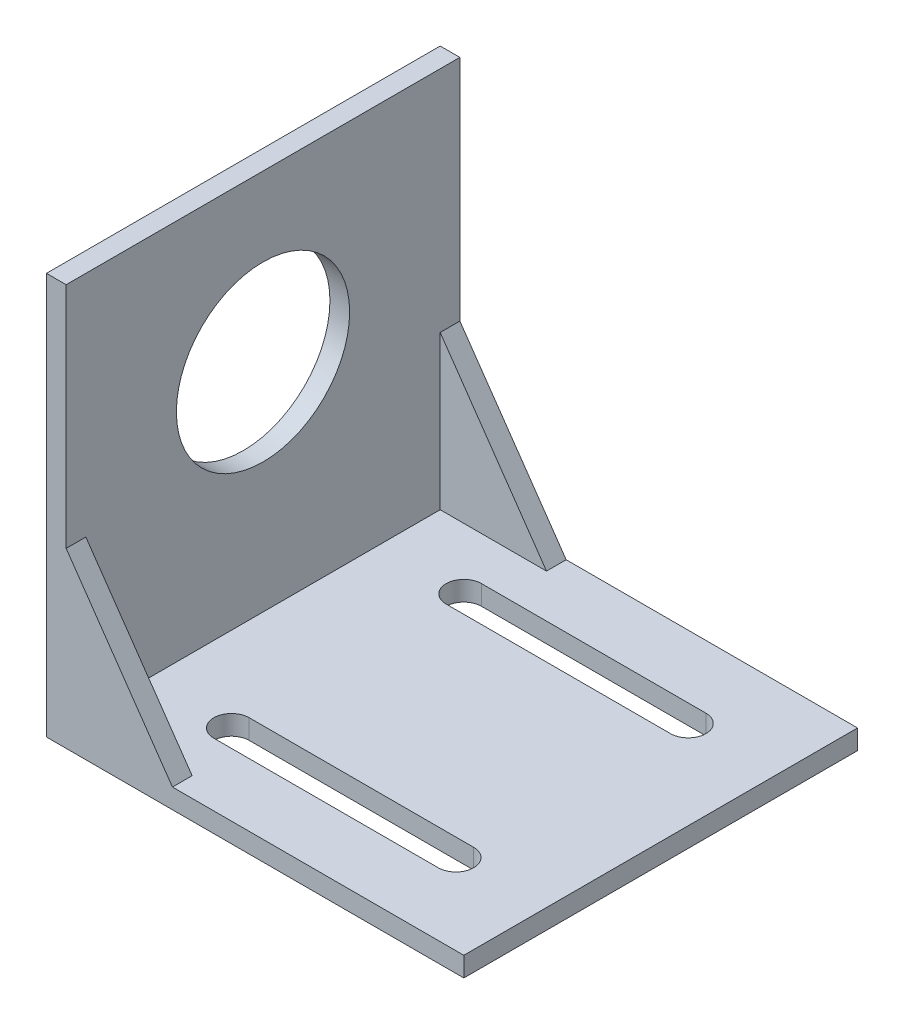
ISO-10303-21;
HEADER;
FILE_DESCRIPTION(('STEP AP214'),'2;1');
FILE_NAME('part.step','',(''),(''),'','','');
FILE_SCHEMA(('AUTOMOTIVE_DESIGN { 1 0 10303 214 1 1 1 1 }'));
ENDSEC;
DATA;
#1=APPLICATION_CONTEXT('core data for automotive mechanical design processes');
#2=APPLICATION_PROTOCOL_DEFINITION('international standard','automotive_design',2000,#1);
#3=PRODUCT_CONTEXT('',#1,'mechanical');
#4=PRODUCT('Part','Part','',(#3));
#5=PRODUCT_RELATED_PRODUCT_CATEGORY('part','',(#4));
#6=PRODUCT_DEFINITION_FORMATION('','',#4);
#7=PRODUCT_DEFINITION_CONTEXT('part definition',#1,'design');
#8=PRODUCT_DEFINITION('design','',#6,#7);
#9=PRODUCT_DEFINITION_SHAPE('','',#8);
#10=(LENGTH_UNIT() NAMED_UNIT(*) SI_UNIT(.MILLI.,.METRE.));
#11=(NAMED_UNIT(*) PLANE_ANGLE_UNIT() SI_UNIT($,.RADIAN.));
#12=(NAMED_UNIT(*) SI_UNIT($,.STERADIAN.) SOLID_ANGLE_UNIT());
#13=UNCERTAINTY_MEASURE_WITH_UNIT(LENGTH_MEASURE(1.E-05),#10,'distance_accuracy_value','');
#14=(GEOMETRIC_REPRESENTATION_CONTEXT(3) GLOBAL_UNCERTAINTY_ASSIGNED_CONTEXT((#13)) GLOBAL_UNIT_ASSIGNED_CONTEXT((#10,
#11,#12)) REPRESENTATION_CONTEXT('',''));
#15=CARTESIAN_POINT('',(0.,0.,0.));
#16=DIRECTION('',(0.,0.,1.));
#17=DIRECTION('',(1.,0.,0.));
#18=AXIS2_PLACEMENT_3D('',#15,#16,#17);
#19=CARTESIAN_POINT('',(2.50000000000001,2.5,25.));
#20=DIRECTION('',(0.,-1.,0.));
#21=DIRECTION('',(0.,0.,-1.));
#22=AXIS2_PLACEMENT_3D('',#19,#20,#21);
#23=PLANE('',#22);
#24=DIRECTION('',(1.,0.,0.));
#25=VECTOR('',#24,1.);
#26=CARTESIAN_POINT('',(13.25,2.5,17.));
#27=LINE('',#26,#25);
#28=CARTESIAN_POINT('',(13.25,2.5,17.));
#29=VERTEX_POINT('',#28);
#30=CARTESIAN_POINT('',(41.75,2.5,17.));
#31=VERTEX_POINT('',#30);
#32=EDGE_CURVE('E240',#29,#31,#27,.T.);
#33=ORIENTED_EDGE('',*,*,#32,.F.);
#34=CARTESIAN_POINT('',(13.25,2.5,14.75));
#35=DIRECTION('',(0.,1.,0.));
#36=DIRECTION('',(0.,0.,1.));
#37=AXIS2_PLACEMENT_3D('',#34,#35,#36);
#38=CIRCLE('',#37,2.25);
#39=CARTESIAN_POINT('',(13.25,2.5,12.5));
#40=VERTEX_POINT('',#39);
#41=EDGE_CURVE('E238',#40,#29,#38,.T.);
#42=ORIENTED_EDGE('',*,*,#41,.F.);
#43=DIRECTION('',(-1.,0.,0.));
#44=VECTOR('',#43,1.);
#45=CARTESIAN_POINT('',(13.25,2.5,12.5));
#46=LINE('',#45,#44);
#47=CARTESIAN_POINT('',(41.75,2.5,12.5));
#48=VERTEX_POINT('',#47);
#49=EDGE_CURVE('E246',#48,#40,#46,.T.);
#50=ORIENTED_EDGE('',*,*,#49,.F.);
#51=CARTESIAN_POINT('',(41.75,2.5,14.75));
#52=DIRECTION('',(0.,1.,0.));
#53=DIRECTION('',(0.,0.,1.));
#54=AXIS2_PLACEMENT_3D('',#51,#52,#53);
#55=CIRCLE('',#54,2.25);
#56=EDGE_CURVE('E243',#31,#48,#55,.T.);
#57=ORIENTED_EDGE('',*,*,#56,.F.);
#58=EDGE_LOOP('',(#33,#42,#50,#57));
#59=FACE_BOUND('',#58,.T.);
#60=DIRECTION('',(1.,0.,0.));
#61=VECTOR('',#60,1.);
#62=CARTESIAN_POINT('',(13.25,2.5,-12.5));
#63=LINE('',#62,#61);
#64=CARTESIAN_POINT('',(13.25,2.5,-12.5));
#65=VERTEX_POINT('',#64);
#66=CARTESIAN_POINT('',(41.75,2.5,-12.5));
#67=VERTEX_POINT('',#66);
#68=EDGE_CURVE('E341',#65,#67,#63,.T.);
#69=ORIENTED_EDGE('',*,*,#68,.F.);
#70=CARTESIAN_POINT('',(13.25,2.5,-14.75));
#71=DIRECTION('',(0.,1.,0.));
#72=DIRECTION('',(0.,0.,1.));
#73=AXIS2_PLACEMENT_3D('',#70,#71,#72);
#74=CIRCLE('',#73,2.25);
#75=CARTESIAN_POINT('',(13.25,2.5,-17.));
#76=VERTEX_POINT('',#75);
#77=EDGE_CURVE('E252',#76,#65,#74,.T.);
#78=ORIENTED_EDGE('',*,*,#77,.F.);
#79=DIRECTION('',(-1.,0.,0.));
#80=VECTOR('',#79,1.);
#81=CARTESIAN_POINT('',(13.25,2.5,-17.));
#82=LINE('',#81,#80);
#83=CARTESIAN_POINT('',(41.75,2.5,-17.));
#84=VERTEX_POINT('',#83);
#85=EDGE_CURVE('E237',#84,#76,#82,.T.);
#86=ORIENTED_EDGE('',*,*,#85,.F.);
#87=CARTESIAN_POINT('',(41.75,2.5,-14.75));
#88=DIRECTION('',(0.,1.,0.));
#89=DIRECTION('',(0.,0.,1.));
#90=AXIS2_PLACEMENT_3D('',#87,#88,#89);
#91=CIRCLE('',#90,2.25);
#92=EDGE_CURVE('E225',#67,#84,#91,.T.);
#93=ORIENTED_EDGE('',*,*,#92,.F.);
#94=EDGE_LOOP('',(#69,#78,#86,#93));
#95=FACE_BOUND('',#94,.T.);
#96=DIRECTION('',(0.,0.,-1.));
#97=VECTOR('',#96,1.);
#98=CARTESIAN_POINT('',(16.,2.5,-22.5));
#99=LINE('',#98,#97);
#100=CARTESIAN_POINT('',(16.,2.5,-22.5));
#101=VERTEX_POINT('',#100);
#102=CARTESIAN_POINT('',(16.,2.5,-25.));
#103=VERTEX_POINT('',#102);
#104=EDGE_CURVE('E53',#101,#103,#99,.T.);
#105=ORIENTED_EDGE('',*,*,#104,.F.);
#106=DIRECTION('',(1.,0.,0.));
#107=VECTOR('',#106,1.);
#108=CARTESIAN_POINT('',(16.,2.5,-22.5));
#109=LINE('',#108,#107);
#110=CARTESIAN_POINT('',(2.50000000000001,2.5,-22.5));
#111=VERTEX_POINT('',#110);
#112=EDGE_CURVE('E180',#111,#101,#109,.T.);
#113=ORIENTED_EDGE('',*,*,#112,.F.);
#114=DIRECTION('',(0.,0.,-1.));
#115=VECTOR('',#114,1.);
#116=CARTESIAN_POINT('',(2.50000000000001,2.5,25.));
#117=LINE('',#116,#115);
#118=CARTESIAN_POINT('',(2.50000000000001,2.5,22.5));
#119=VERTEX_POINT('',#118);
#120=EDGE_CURVE('E175',#119,#111,#117,.T.);
#121=ORIENTED_EDGE('',*,*,#120,.F.);
#122=DIRECTION('',(1.,0.,0.));
#123=VECTOR('',#122,1.);
#124=CARTESIAN_POINT('',(16.,2.5,22.5));
#125=LINE('',#124,#123);
#126=CARTESIAN_POINT('',(16.,2.5,22.5));
#127=VERTEX_POINT('',#126);
#128=EDGE_CURVE('E164',#119,#127,#125,.T.);
#129=ORIENTED_EDGE('',*,*,#128,.T.);
#130=DIRECTION('',(0.,0.,1.));
#131=VECTOR('',#130,1.);
#132=CARTESIAN_POINT('',(16.,2.5,22.5));
#133=LINE('',#132,#131);
#134=CARTESIAN_POINT('',(16.,2.5,25.));
#135=VERTEX_POINT('',#134);
#136=EDGE_CURVE('E333',#127,#135,#133,.T.);
#137=ORIENTED_EDGE('',*,*,#136,.T.);
#138=DIRECTION('',(-1.,0.,0.));
#139=VECTOR('',#138,1.);
#140=CARTESIAN_POINT('',(2.50000000000001,2.5,25.));
#141=LINE('',#140,#139);
#142=CARTESIAN_POINT('',(53.,2.5,25.));
#143=VERTEX_POINT('',#142);
#144=EDGE_CURVE('E262',#143,#135,#141,.T.);
#145=ORIENTED_EDGE('',*,*,#144,.F.);
#146=DIRECTION('',(0.,0.,-1.));
#147=VECTOR('',#146,1.);
#148=CARTESIAN_POINT('',(53.,2.5,25.));
#149=LINE('',#148,#147);
#150=CARTESIAN_POINT('',(53.,2.5,-25.));
#151=VERTEX_POINT('',#150);
#152=EDGE_CURVE('E181',#143,#151,#149,.T.);
#153=ORIENTED_EDGE('',*,*,#152,.T.);
#154=DIRECTION('',(-1.,0.,0.));
#155=VECTOR('',#154,1.);
#156=CARTESIAN_POINT('',(2.50000000000001,2.5,-25.));
#157=LINE('',#156,#155);
#158=EDGE_CURVE('E277',#151,#103,#157,.T.);
#159=ORIENTED_EDGE('',*,*,#158,.T.);
#160=EDGE_LOOP('',(#105,#113,#121,#129,#137,#145,#153,#159));
#161=FACE_BOUND('',#160,.T.);
#162=ADVANCED_FACE('F37',(#59,#95,#161),#23,.F.);
#163=CARTESIAN_POINT('',(2.5,51.,25.));
#164=DIRECTION('',(-1.,0.,0.));
#165=DIRECTION('',(0.,-1.,0.));
#166=AXIS2_PLACEMENT_3D('',#163,#164,#165);
#167=PLANE('',#166);
#168=CARTESIAN_POINT('',(2.5,30.,0.));
#169=DIRECTION('',(1.,0.,0.));
#170=DIRECTION('',(0.,1.,0.));
#171=AXIS2_PLACEMENT_3D('',#168,#169,#170);
#172=CIRCLE('',#171,11.);
#173=CARTESIAN_POINT('',(2.5,41.,0.));
#174=VERTEX_POINT('',#173);
#175=EDGE_CURVE('E336',#174,#174,#172,.T.);
#176=ORIENTED_EDGE('',*,*,#175,.F.);
#177=EDGE_LOOP('',(#176));
#178=FACE_BOUND('',#177,.T.);
#179=DIRECTION('',(0.,0.,-1.));
#180=VECTOR('',#179,1.);
#181=CARTESIAN_POINT('',(2.5,22.,-22.5));
#182=LINE('',#181,#180);
#183=CARTESIAN_POINT('',(2.5,22.,-22.5));
#184=VERTEX_POINT('',#183);
#185=CARTESIAN_POINT('',(2.49999999999999,22.,-25.));
#186=VERTEX_POINT('',#185);
#187=EDGE_CURVE('E317',#184,#186,#182,.T.);
#188=ORIENTED_EDGE('',*,*,#187,.T.);
#189=DIRECTION('',(0.,1.,0.));
#190=VECTOR('',#189,1.);
#191=CARTESIAN_POINT('',(2.5,51.,-25.));
#192=LINE('',#191,#190);
#193=CARTESIAN_POINT('',(2.5,51.,-25.));
#194=VERTEX_POINT('',#193);
#195=EDGE_CURVE('E279',#186,#194,#192,.T.);
#196=ORIENTED_EDGE('',*,*,#195,.T.);
#197=DIRECTION('',(0.,0.,-1.));
#198=VECTOR('',#197,1.);
#199=CARTESIAN_POINT('',(2.5,51.,25.));
#200=LINE('',#199,#198);
#201=CARTESIAN_POINT('',(2.5,51.,25.));
#202=VERTEX_POINT('',#201);
#203=EDGE_CURVE('E182',#202,#194,#200,.T.);
#204=ORIENTED_EDGE('',*,*,#203,.F.);
#205=DIRECTION('',(0.,1.,0.));
#206=VECTOR('',#205,1.);
#207=CARTESIAN_POINT('',(2.5,51.,25.));
#208=LINE('',#207,#206);
#209=CARTESIAN_POINT('',(2.5,22.,25.));
#210=VERTEX_POINT('',#209);
#211=EDGE_CURVE('E266',#210,#202,#208,.T.);
#212=ORIENTED_EDGE('',*,*,#211,.F.);
#213=DIRECTION('',(0.,0.,1.));
#214=VECTOR('',#213,1.);
#215=CARTESIAN_POINT('',(2.5,22.,22.5));
#216=LINE('',#215,#214);
#217=CARTESIAN_POINT('',(2.5,22.,22.5));
#218=VERTEX_POINT('',#217);
#219=EDGE_CURVE('E177',#218,#210,#216,.T.);
#220=ORIENTED_EDGE('',*,*,#219,.F.);
#221=DIRECTION('',(0.,-1.,0.));
#222=VECTOR('',#221,1.);
#223=CARTESIAN_POINT('',(2.50000000000001,2.5,22.5));
#224=LINE('',#223,#222);
#225=EDGE_CURVE('E167',#218,#119,#224,.T.);
#226=ORIENTED_EDGE('',*,*,#225,.T.);
#227=ORIENTED_EDGE('',*,*,#120,.T.);
#228=DIRECTION('',(0.,-1.,0.));
#229=VECTOR('',#228,1.);
#230=CARTESIAN_POINT('',(2.50000000000001,2.5,-22.5));
#231=LINE('',#230,#229);
#232=EDGE_CURVE('E61',#184,#111,#231,.T.);
#233=ORIENTED_EDGE('',*,*,#232,.F.);
#234=EDGE_LOOP('',(#188,#196,#204,#212,#220,#226,#227,#233));
#235=FACE_BOUND('',#234,.T.);
#236=ADVANCED_FACE('F174',(#178,#235),#167,.F.);
#237=CARTESIAN_POINT('',(53.,2.5,25.));
#238=DIRECTION('',(-1.,0.,0.));
#239=DIRECTION('',(0.,0.,1.));
#240=AXIS2_PLACEMENT_3D('',#237,#238,#239);
#241=PLANE('',#240);
#242=DIRECTION('',(0.,1.,0.));
#243=VECTOR('',#242,1.);
#244=CARTESIAN_POINT('',(53.,2.5,-25.));
#245=LINE('',#244,#243);
#246=CARTESIAN_POINT('',(53.,0.,-25.));
#247=VERTEX_POINT('',#246);
#248=EDGE_CURVE('E229',#247,#151,#245,.T.);
#249=ORIENTED_EDGE('',*,*,#248,.T.);
#250=ORIENTED_EDGE('',*,*,#152,.F.);
#251=DIRECTION('',(0.,1.,0.));
#252=VECTOR('',#251,1.);
#253=CARTESIAN_POINT('',(53.,2.5,25.));
#254=LINE('',#253,#252);
#255=CARTESIAN_POINT('',(53.,0.,25.));
#256=VERTEX_POINT('',#255);
#257=EDGE_CURVE('E259',#256,#143,#254,.T.);
#258=ORIENTED_EDGE('',*,*,#257,.F.);
#259=DIRECTION('',(0.,0.,-1.));
#260=VECTOR('',#259,1.);
#261=CARTESIAN_POINT('',(53.,0.,25.));
#262=LINE('',#261,#260);
#263=EDGE_CURVE('E274',#256,#247,#262,.T.);
#264=ORIENTED_EDGE('',*,*,#263,.T.);
#265=EDGE_LOOP('',(#249,#250,#258,#264));
#266=FACE_BOUND('',#265,.T.);
#267=ADVANCED_FACE('F39',(#266),#241,.F.);
#268=CARTESIAN_POINT('',(0.,51.,25.));
#269=DIRECTION('',(0.,-1.,0.));
#270=DIRECTION('',(0.,0.,-1.));
#271=AXIS2_PLACEMENT_3D('',#268,#269,#270);
#272=PLANE('',#271);
#273=DIRECTION('',(-1.,0.,0.));
#274=VECTOR('',#273,1.);
#275=CARTESIAN_POINT('',(0.,51.,-25.));
#276=LINE('',#275,#274);
#277=CARTESIAN_POINT('',(0.,51.,-25.));
#278=VERTEX_POINT('',#277);
#279=EDGE_CURVE('E281',#194,#278,#276,.T.);
#280=ORIENTED_EDGE('',*,*,#279,.T.);
#281=DIRECTION('',(0.,0.,-1.));
#282=VECTOR('',#281,1.);
#283=CARTESIAN_POINT('',(0.,51.,25.));
#284=LINE('',#283,#282);
#285=CARTESIAN_POINT('',(0.,51.,25.));
#286=VERTEX_POINT('',#285);
#287=EDGE_CURVE('E188',#286,#278,#284,.T.);
#288=ORIENTED_EDGE('',*,*,#287,.F.);
#289=DIRECTION('',(-1.,0.,0.));
#290=VECTOR('',#289,1.);
#291=CARTESIAN_POINT('',(0.,51.,25.));
#292=LINE('',#291,#290);
#293=EDGE_CURVE('E268',#202,#286,#292,.T.);
#294=ORIENTED_EDGE('',*,*,#293,.F.);
#295=ORIENTED_EDGE('',*,*,#203,.T.);
#296=EDGE_LOOP('',(#280,#288,#294,#295));
#297=FACE_BOUND('',#296,.T.);
#298=ADVANCED_FACE('F315',(#297),#272,.F.);
#299=CARTESIAN_POINT('',(0.,0.,25.));
#300=DIRECTION('',(1.,0.,0.));
#301=DIRECTION('',(0.,0.,-1.));
#302=AXIS2_PLACEMENT_3D('',#299,#300,#301);
#303=PLANE('',#302);
#304=CARTESIAN_POINT('',(0.,30.,0.));
#305=DIRECTION('',(1.,0.,0.));
#306=DIRECTION('',(0.,0.,-1.));
#307=AXIS2_PLACEMENT_3D('',#304,#305,#306);
#308=CIRCLE('',#307,11.);
#309=CARTESIAN_POINT('',(0.,30.,-11.));
#310=VERTEX_POINT('',#309);
#311=EDGE_CURVE('E41',#310,#310,#308,.T.);
#312=ORIENTED_EDGE('',*,*,#311,.T.);
#313=EDGE_LOOP('',(#312));
#314=FACE_BOUND('',#313,.T.);
#315=DIRECTION('',(0.,-1.,0.));
#316=VECTOR('',#315,1.);
#317=CARTESIAN_POINT('',(0.,0.,-25.));
#318=LINE('',#317,#316);
#319=CARTESIAN_POINT('',(0.,0.,-25.));
#320=VERTEX_POINT('',#319);
#321=EDGE_CURVE('E283',#278,#320,#318,.T.);
#322=ORIENTED_EDGE('',*,*,#321,.T.);
#323=DIRECTION('',(0.,0.,-1.));
#324=VECTOR('',#323,1.);
#325=CARTESIAN_POINT('',(0.,0.,25.));
#326=LINE('',#325,#324);
#327=CARTESIAN_POINT('',(0.,0.,25.));
#328=VERTEX_POINT('',#327);
#329=EDGE_CURVE('E288',#328,#320,#326,.T.);
#330=ORIENTED_EDGE('',*,*,#329,.F.);
#331=DIRECTION('',(0.,-1.,0.));
#332=VECTOR('',#331,1.);
#333=CARTESIAN_POINT('',(0.,0.,25.));
#334=LINE('',#333,#332);
#335=EDGE_CURVE('E270',#286,#328,#334,.T.);
#336=ORIENTED_EDGE('',*,*,#335,.F.);
#337=ORIENTED_EDGE('',*,*,#287,.T.);
#338=EDGE_LOOP('',(#322,#330,#336,#337));
#339=FACE_BOUND('',#338,.T.);
#340=ADVANCED_FACE('F295',(#314,#339),#303,.F.);
#341=CARTESIAN_POINT('',(53.,0.,25.));
#342=DIRECTION('',(0.,1.,0.));
#343=DIRECTION('',(-1.,0.,0.));
#344=AXIS2_PLACEMENT_3D('',#341,#342,#343);
#345=PLANE('',#344);
#346=DIRECTION('',(-1.,0.,0.));
#347=VECTOR('',#346,1.);
#348=CARTESIAN_POINT('',(53.,0.,-17.));
#349=LINE('',#348,#347);
#350=CARTESIAN_POINT('',(41.75,0.,-17.));
#351=VERTEX_POINT('',#350);
#352=CARTESIAN_POINT('',(13.25,0.,-17.));
#353=VERTEX_POINT('',#352);
#354=EDGE_CURVE('E46',#351,#353,#349,.T.);
#355=ORIENTED_EDGE('',*,*,#354,.T.);
#356=CARTESIAN_POINT('',(13.25,0.,-14.75));
#357=DIRECTION('',(0.,1.,0.));
#358=DIRECTION('',(-1.,0.,0.));
#359=AXIS2_PLACEMENT_3D('',#356,#357,#358);
#360=CIRCLE('',#359,2.25);
#361=CARTESIAN_POINT('',(13.25,0.,-12.5));
#362=VERTEX_POINT('',#361);
#363=EDGE_CURVE('E11',#353,#362,#360,.T.);
#364=ORIENTED_EDGE('',*,*,#363,.T.);
#365=DIRECTION('',(1.,0.,0.));
#366=VECTOR('',#365,1.);
#367=CARTESIAN_POINT('',(53.,0.,-12.5));
#368=LINE('',#367,#366);
#369=CARTESIAN_POINT('',(41.75,0.,-12.5));
#370=VERTEX_POINT('',#369);
#371=EDGE_CURVE('E203',#362,#370,#368,.T.);
#372=ORIENTED_EDGE('',*,*,#371,.T.);
#373=CARTESIAN_POINT('',(41.75,0.,-14.75));
#374=DIRECTION('',(0.,1.,0.));
#375=DIRECTION('',(-1.,0.,0.));
#376=AXIS2_PLACEMENT_3D('',#373,#374,#375);
#377=CIRCLE('',#376,2.25);
#378=EDGE_CURVE('E206',#370,#351,#377,.T.);
#379=ORIENTED_EDGE('',*,*,#378,.T.);
#380=EDGE_LOOP('',(#355,#364,#372,#379));
#381=FACE_BOUND('',#380,.T.);
#382=DIRECTION('',(-1.,0.,0.));
#383=VECTOR('',#382,1.);
#384=CARTESIAN_POINT('',(53.,0.,12.5));
#385=LINE('',#384,#383);
#386=CARTESIAN_POINT('',(41.75,0.,12.5));
#387=VERTEX_POINT('',#386);
#388=CARTESIAN_POINT('',(13.25,0.,12.5));
#389=VERTEX_POINT('',#388);
#390=EDGE_CURVE('E197',#387,#389,#385,.T.);
#391=ORIENTED_EDGE('',*,*,#390,.T.);
#392=CARTESIAN_POINT('',(13.25,0.,14.75));
#393=DIRECTION('',(0.,1.,0.));
#394=DIRECTION('',(-1.,0.,0.));
#395=AXIS2_PLACEMENT_3D('',#392,#393,#394);
#396=CIRCLE('',#395,2.25);
#397=CARTESIAN_POINT('',(13.25,0.,17.));
#398=VERTEX_POINT('',#397);
#399=EDGE_CURVE('E200',#389,#398,#396,.T.);
#400=ORIENTED_EDGE('',*,*,#399,.T.);
#401=DIRECTION('',(1.,0.,0.));
#402=VECTOR('',#401,1.);
#403=CARTESIAN_POINT('',(53.,0.,17.));
#404=LINE('',#403,#402);
#405=CARTESIAN_POINT('',(41.75,0.,17.));
#406=VERTEX_POINT('',#405);
#407=EDGE_CURVE('E185',#398,#406,#404,.T.);
#408=ORIENTED_EDGE('',*,*,#407,.T.);
#409=CARTESIAN_POINT('',(41.75,0.,14.75));
#410=DIRECTION('',(0.,1.,0.));
#411=DIRECTION('',(-1.,0.,0.));
#412=AXIS2_PLACEMENT_3D('',#409,#410,#411);
#413=CIRCLE('',#412,2.25);
#414=EDGE_CURVE('E194',#406,#387,#413,.T.);
#415=ORIENTED_EDGE('',*,*,#414,.T.);
#416=EDGE_LOOP('',(#391,#400,#408,#415));
#417=FACE_BOUND('',#416,.T.);
#418=DIRECTION('',(1.,0.,0.));
#419=VECTOR('',#418,1.);
#420=CARTESIAN_POINT('',(53.,0.,-25.));
#421=LINE('',#420,#419);
#422=EDGE_CURVE('E263',#320,#247,#421,.T.);
#423=ORIENTED_EDGE('',*,*,#422,.T.);
#424=ORIENTED_EDGE('',*,*,#263,.F.);
#425=DIRECTION('',(1.,0.,0.));
#426=VECTOR('',#425,1.);
#427=CARTESIAN_POINT('',(53.,0.,25.));
#428=LINE('',#427,#426);
#429=EDGE_CURVE('E272',#328,#256,#428,.T.);
#430=ORIENTED_EDGE('',*,*,#429,.F.);
#431=ORIENTED_EDGE('',*,*,#329,.T.);
#432=EDGE_LOOP('',(#423,#424,#430,#431));
#433=FACE_BOUND('',#432,.T.);
#434=ADVANCED_FACE('F211',(#381,#417,#433),#345,.F.);
#435=CARTESIAN_POINT('',(0.,0.,25.));
#436=DIRECTION('',(0.,0.,-1.));
#437=DIRECTION('',(-1.,0.,0.));
#438=AXIS2_PLACEMENT_3D('',#435,#436,#437);
#439=PLANE('',#438);
#440=DIRECTION('',(-0.569209978830308,0.822192191643779,0.));
#441=VECTOR('',#440,1.);
#442=CARTESIAN_POINT('',(2.5,22.,25.));
#443=LINE('',#442,#441);
#444=EDGE_CURVE('E178',#135,#210,#443,.T.);
#445=ORIENTED_EDGE('',*,*,#444,.T.);
#446=ORIENTED_EDGE('',*,*,#211,.T.);
#447=ORIENTED_EDGE('',*,*,#293,.T.);
#448=ORIENTED_EDGE('',*,*,#335,.T.);
#449=ORIENTED_EDGE('',*,*,#429,.T.);
#450=ORIENTED_EDGE('',*,*,#257,.T.);
#451=ORIENTED_EDGE('',*,*,#144,.T.);
#452=EDGE_LOOP('',(#445,#446,#447,#448,#449,#450,#451));
#453=FACE_BOUND('',#452,.T.);
#454=ADVANCED_FACE('F313',(#453),#439,.F.);
#455=CARTESIAN_POINT('',(0.,0.,-25.));
#456=DIRECTION('',(0.,0.,-1.));
#457=DIRECTION('',(-1.,0.,0.));
#458=AXIS2_PLACEMENT_3D('',#455,#456,#457);
#459=PLANE('',#458);
#460=ORIENTED_EDGE('',*,*,#195,.F.);
#461=DIRECTION('',(-0.569209978830308,0.822192191643779,0.));
#462=VECTOR('',#461,1.);
#463=CARTESIAN_POINT('',(2.5,22.,-25.));
#464=LINE('',#463,#462);
#465=EDGE_CURVE('E320',#103,#186,#464,.T.);
#466=ORIENTED_EDGE('',*,*,#465,.F.);
#467=ORIENTED_EDGE('',*,*,#158,.F.);
#468=ORIENTED_EDGE('',*,*,#248,.F.);
#469=ORIENTED_EDGE('',*,*,#422,.F.);
#470=ORIENTED_EDGE('',*,*,#321,.F.);
#471=ORIENTED_EDGE('',*,*,#279,.F.);
#472=EDGE_LOOP('',(#460,#466,#467,#468,#469,#470,#471));
#473=FACE_BOUND('',#472,.T.);
#474=ADVANCED_FACE('F303',(#473),#459,.T.);
#475=CARTESIAN_POINT('',(13.25,-7.5,14.75));
#476=DIRECTION('',(0.,1.,0.));
#477=DIRECTION('',(0.,0.,1.));
#478=AXIS2_PLACEMENT_3D('',#475,#476,#477);
#479=CYLINDRICAL_SURFACE('',#478,2.25);
#480=DIRECTION('',(0.,1.,0.));
#481=VECTOR('',#480,1.);
#482=CARTESIAN_POINT('',(13.25,-7.5,12.5));
#483=LINE('',#482,#481);
#484=EDGE_CURVE('E250',#389,#40,#483,.T.);
#485=ORIENTED_EDGE('',*,*,#484,.T.);
#486=ORIENTED_EDGE('',*,*,#41,.T.);
#487=DIRECTION('',(0.,1.,0.));
#488=VECTOR('',#487,1.);
#489=CARTESIAN_POINT('',(13.25,-7.5,17.));
#490=LINE('',#489,#488);
#491=EDGE_CURVE('E249',#398,#29,#490,.T.);
#492=ORIENTED_EDGE('',*,*,#491,.F.);
#493=ORIENTED_EDGE('',*,*,#399,.F.);
#494=EDGE_LOOP('',(#485,#486,#492,#493));
#495=FACE_BOUND('',#494,.T.);
#496=ADVANCED_FACE('F382',(#495),#479,.F.);
#497=CARTESIAN_POINT('',(13.25,-7.5,12.5));
#498=DIRECTION('',(0.,0.,-1.));
#499=DIRECTION('',(-1.,0.,0.));
#500=AXIS2_PLACEMENT_3D('',#497,#498,#499);
#501=PLANE('',#500);
#502=DIRECTION('',(0.,1.,0.));
#503=VECTOR('',#502,1.);
#504=CARTESIAN_POINT('',(41.75,-7.5,12.5));
#505=LINE('',#504,#503);
#506=EDGE_CURVE('E253',#387,#48,#505,.T.);
#507=ORIENTED_EDGE('',*,*,#506,.T.);
#508=ORIENTED_EDGE('',*,*,#49,.T.);
#509=ORIENTED_EDGE('',*,*,#484,.F.);
#510=ORIENTED_EDGE('',*,*,#390,.F.);
#511=EDGE_LOOP('',(#507,#508,#509,#510));
#512=FACE_BOUND('',#511,.T.);
#513=ADVANCED_FACE('F387',(#512),#501,.F.);
#514=CARTESIAN_POINT('',(41.75,-7.5,14.75));
#515=DIRECTION('',(0.,1.,0.));
#516=DIRECTION('',(0.,0.,1.));
#517=AXIS2_PLACEMENT_3D('',#514,#515,#516);
#518=CYLINDRICAL_SURFACE('',#517,2.25);
#519=DIRECTION('',(0.,1.,0.));
#520=VECTOR('',#519,1.);
#521=CARTESIAN_POINT('',(41.75,-7.5,17.));
#522=LINE('',#521,#520);
#523=EDGE_CURVE('E255',#406,#31,#522,.T.);
#524=ORIENTED_EDGE('',*,*,#523,.T.);
#525=ORIENTED_EDGE('',*,*,#56,.T.);
#526=ORIENTED_EDGE('',*,*,#506,.F.);
#527=ORIENTED_EDGE('',*,*,#414,.F.);
#528=EDGE_LOOP('',(#524,#525,#526,#527));
#529=FACE_BOUND('',#528,.T.);
#530=ADVANCED_FACE('F392',(#529),#518,.F.);
#531=CARTESIAN_POINT('',(13.25,-7.5,17.));
#532=DIRECTION('',(0.,0.,1.));
#533=DIRECTION('',(1.,0.,0.));
#534=AXIS2_PLACEMENT_3D('',#531,#532,#533);
#535=PLANE('',#534);
#536=ORIENTED_EDGE('',*,*,#491,.T.);
#537=ORIENTED_EDGE('',*,*,#32,.T.);
#538=ORIENTED_EDGE('',*,*,#523,.F.);
#539=ORIENTED_EDGE('',*,*,#407,.F.);
#540=EDGE_LOOP('',(#536,#537,#538,#539));
#541=FACE_BOUND('',#540,.T.);
#542=ADVANCED_FACE('F389',(#541),#535,.F.);
#543=CARTESIAN_POINT('',(13.25,-7.5,-14.75));
#544=DIRECTION('',(0.,1.,0.));
#545=DIRECTION('',(0.,0.,1.));
#546=AXIS2_PLACEMENT_3D('',#543,#544,#545);
#547=CYLINDRICAL_SURFACE('',#546,2.25);
#548=DIRECTION('',(0.,1.,0.));
#549=VECTOR('',#548,1.);
#550=CARTESIAN_POINT('',(13.25,-7.5,-17.));
#551=LINE('',#550,#549);
#552=EDGE_CURVE('E221',#353,#76,#551,.T.);
#553=ORIENTED_EDGE('',*,*,#552,.T.);
#554=ORIENTED_EDGE('',*,*,#77,.T.);
#555=DIRECTION('',(0.,1.,0.));
#556=VECTOR('',#555,1.);
#557=CARTESIAN_POINT('',(13.25,-7.5,-12.5));
#558=LINE('',#557,#556);
#559=EDGE_CURVE('E231',#362,#65,#558,.T.);
#560=ORIENTED_EDGE('',*,*,#559,.F.);
#561=ORIENTED_EDGE('',*,*,#363,.F.);
#562=EDGE_LOOP('',(#553,#554,#560,#561));
#563=FACE_BOUND('',#562,.T.);
#564=ADVANCED_FACE('F349',(#563),#547,.F.);
#565=CARTESIAN_POINT('',(13.25,-7.5,-17.));
#566=DIRECTION('',(0.,0.,-1.));
#567=DIRECTION('',(-1.,0.,0.));
#568=AXIS2_PLACEMENT_3D('',#565,#566,#567);
#569=PLANE('',#568);
#570=DIRECTION('',(0.,1.,0.));
#571=VECTOR('',#570,1.);
#572=CARTESIAN_POINT('',(41.75,-7.5,-17.));
#573=LINE('',#572,#571);
#574=EDGE_CURVE('E219',#351,#84,#573,.T.);
#575=ORIENTED_EDGE('',*,*,#574,.T.);
#576=ORIENTED_EDGE('',*,*,#85,.T.);
#577=ORIENTED_EDGE('',*,*,#552,.F.);
#578=ORIENTED_EDGE('',*,*,#354,.F.);
#579=EDGE_LOOP('',(#575,#576,#577,#578));
#580=FACE_BOUND('',#579,.T.);
#581=ADVANCED_FACE('F217',(#580),#569,.F.);
#582=CARTESIAN_POINT('',(41.75,-7.5,-14.75));
#583=DIRECTION('',(0.,1.,0.));
#584=DIRECTION('',(0.,0.,1.));
#585=AXIS2_PLACEMENT_3D('',#582,#583,#584);
#586=CYLINDRICAL_SURFACE('',#585,2.25);
#587=DIRECTION('',(0.,1.,0.));
#588=VECTOR('',#587,1.);
#589=CARTESIAN_POINT('',(41.75,-7.5,-12.5));
#590=LINE('',#589,#588);
#591=EDGE_CURVE('E227',#370,#67,#590,.T.);
#592=ORIENTED_EDGE('',*,*,#591,.T.);
#593=ORIENTED_EDGE('',*,*,#92,.T.);
#594=ORIENTED_EDGE('',*,*,#574,.F.);
#595=ORIENTED_EDGE('',*,*,#378,.F.);
#596=EDGE_LOOP('',(#592,#593,#594,#595));
#597=FACE_BOUND('',#596,.T.);
#598=ADVANCED_FACE('F223',(#597),#586,.F.);
#599=CARTESIAN_POINT('',(13.25,-7.5,-12.5));
#600=DIRECTION('',(0.,0.,1.));
#601=DIRECTION('',(1.,0.,0.));
#602=AXIS2_PLACEMENT_3D('',#599,#600,#601);
#603=PLANE('',#602);
#604=ORIENTED_EDGE('',*,*,#559,.T.);
#605=ORIENTED_EDGE('',*,*,#68,.T.);
#606=ORIENTED_EDGE('',*,*,#591,.F.);
#607=ORIENTED_EDGE('',*,*,#371,.F.);
#608=EDGE_LOOP('',(#604,#605,#606,#607));
#609=FACE_BOUND('',#608,.T.);
#610=ADVANCED_FACE('F351',(#609),#603,.F.);
#611=CARTESIAN_POINT('',(-7.49999999999999,30.,0.));
#612=DIRECTION('',(1.,0.,0.));
#613=DIRECTION('',(0.,1.,0.));
#614=AXIS2_PLACEMENT_3D('',#611,#612,#613);
#615=CYLINDRICAL_SURFACE('',#614,11.);
#616=ORIENTED_EDGE('',*,*,#175,.T.);
#617=EDGE_LOOP('',(#616));
#618=FACE_BOUND('',#617,.T.);
#619=ORIENTED_EDGE('',*,*,#311,.F.);
#620=EDGE_LOOP('',(#619));
#621=FACE_BOUND('',#620,.T.);
#622=ADVANCED_FACE('F353',(#618,#621),#615,.F.);
#623=CARTESIAN_POINT('',(2.5,22.,22.5));
#624=DIRECTION('',(0.822192191643779,0.569209978830308,0.));
#625=DIRECTION('',(-0.569209978830308,0.822192191643779,0.));
#626=AXIS2_PLACEMENT_3D('',#623,#624,#625);
#627=PLANE('',#626);
#628=ORIENTED_EDGE('',*,*,#444,.F.);
#629=ORIENTED_EDGE('',*,*,#136,.F.);
#630=DIRECTION('',(-0.569209978830308,0.822192191643779,0.));
#631=VECTOR('',#630,1.);
#632=CARTESIAN_POINT('',(2.5,22.,22.5));
#633=LINE('',#632,#631);
#634=EDGE_CURVE('E169',#127,#218,#633,.T.);
#635=ORIENTED_EDGE('',*,*,#634,.T.);
#636=ORIENTED_EDGE('',*,*,#219,.T.);
#637=EDGE_LOOP('',(#628,#629,#635,#636));
#638=FACE_BOUND('',#637,.T.);
#639=ADVANCED_FACE('F359',(#638),#627,.T.);
#640=CARTESIAN_POINT('',(0.,0.,22.5));
#641=DIRECTION('',(0.,0.,1.));
#642=DIRECTION('',(1.,0.,0.));
#643=AXIS2_PLACEMENT_3D('',#640,#641,#642);
#644=PLANE('',#643);
#645=ORIENTED_EDGE('',*,*,#225,.F.);
#646=ORIENTED_EDGE('',*,*,#634,.F.);
#647=ORIENTED_EDGE('',*,*,#128,.F.);
#648=EDGE_LOOP('',(#645,#646,#647));
#649=FACE_BOUND('',#648,.T.);
#650=ADVANCED_FACE('F166',(#649),#644,.F.);
#651=CARTESIAN_POINT('',(2.5,22.,-22.5));
#652=DIRECTION('',(-0.822192191643779,-0.569209978830308,0.));
#653=DIRECTION('',(0.569209978830308,-0.822192191643779,0.));
#654=AXIS2_PLACEMENT_3D('',#651,#652,#653);
#655=PLANE('',#654);
#656=ORIENTED_EDGE('',*,*,#465,.T.);
#657=ORIENTED_EDGE('',*,*,#187,.F.);
#658=DIRECTION('',(-0.569209978830308,0.822192191643779,0.));
#659=VECTOR('',#658,1.);
#660=CARTESIAN_POINT('',(2.5,22.,-22.5));
#661=LINE('',#660,#659);
#662=EDGE_CURVE('E325',#101,#184,#661,.T.);
#663=ORIENTED_EDGE('',*,*,#662,.F.);
#664=ORIENTED_EDGE('',*,*,#104,.T.);
#665=EDGE_LOOP('',(#656,#657,#663,#664));
#666=FACE_BOUND('',#665,.T.);
#667=ADVANCED_FACE('F322',(#666),#655,.F.);
#668=CARTESIAN_POINT('',(0.,0.,-22.5));
#669=DIRECTION('',(0.,0.,-1.));
#670=DIRECTION('',(1.,0.,0.));
#671=AXIS2_PLACEMENT_3D('',#668,#669,#670);
#672=PLANE('',#671);
#673=ORIENTED_EDGE('',*,*,#232,.T.);
#674=ORIENTED_EDGE('',*,*,#112,.T.);
#675=ORIENTED_EDGE('',*,*,#662,.T.);
#676=EDGE_LOOP('',(#673,#674,#675));
#677=FACE_BOUND('',#676,.T.);
#678=ADVANCED_FACE('F414',(#677),#672,.F.);
#679=CLOSED_SHELL('',(#162,#236,#267,#298,#340,#434,#454,#474,#496,#513,#530,#542,#564,#581,
#598,#610,#622,#639,#650,#667,#678));
#680=MANIFOLD_SOLID_BREP('B2',#679);
#681=ADVANCED_BREP_SHAPE_REPRESENTATION('',(#18,#680),#14);
#682=SHAPE_DEFINITION_REPRESENTATION(#9,#681);
ENDSEC;
END-ISO-10303-21;
